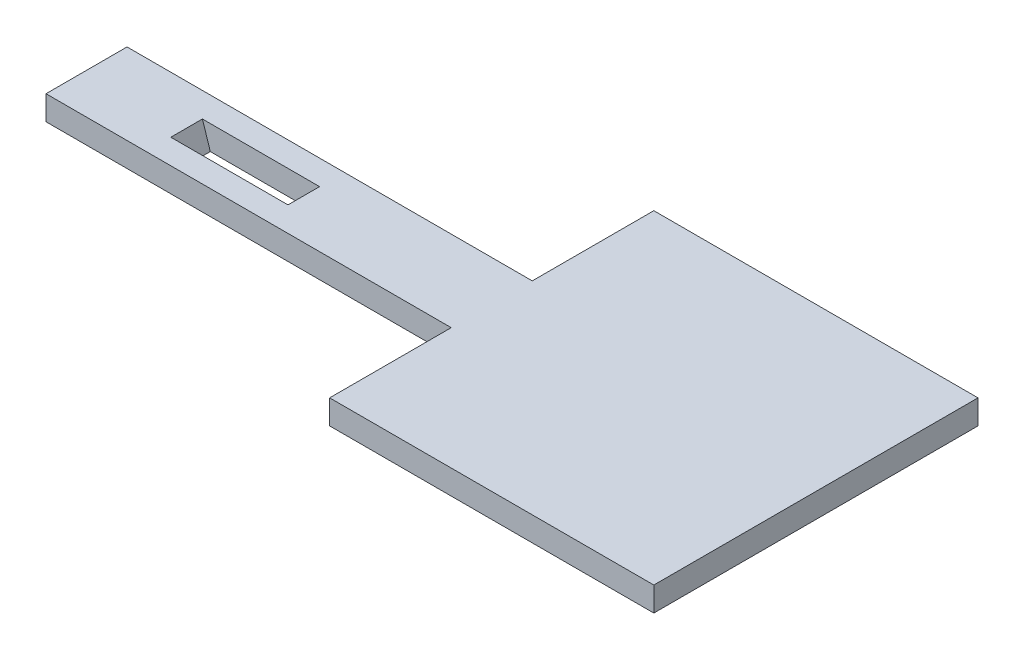
ISO-10303-21;
HEADER;
FILE_DESCRIPTION(('STEP AP214'),'2;1');
FILE_NAME('part.step','',(''),(''),'','','');
FILE_SCHEMA(('AUTOMOTIVE_DESIGN { 1 0 10303 214 1 1 1 1 }'));
ENDSEC;
DATA;
#1=APPLICATION_CONTEXT('core data for automotive mechanical design processes');
#2=APPLICATION_PROTOCOL_DEFINITION('international standard','automotive_design',2000,#1);
#3=PRODUCT_CONTEXT('',#1,'mechanical');
#4=PRODUCT('Part','Part','',(#3));
#5=PRODUCT_RELATED_PRODUCT_CATEGORY('part','',(#4));
#6=PRODUCT_DEFINITION_FORMATION('','',#4);
#7=PRODUCT_DEFINITION_CONTEXT('part definition',#1,'design');
#8=PRODUCT_DEFINITION('design','',#6,#7);
#9=PRODUCT_DEFINITION_SHAPE('','',#8);
#10=(LENGTH_UNIT() NAMED_UNIT(*) SI_UNIT(.MILLI.,.METRE.));
#11=(NAMED_UNIT(*) PLANE_ANGLE_UNIT() SI_UNIT($,.RADIAN.));
#12=(NAMED_UNIT(*) SI_UNIT($,.STERADIAN.) SOLID_ANGLE_UNIT());
#13=UNCERTAINTY_MEASURE_WITH_UNIT(LENGTH_MEASURE(1.E-05),#10,'distance_accuracy_value','');
#14=(GEOMETRIC_REPRESENTATION_CONTEXT(3) GLOBAL_UNCERTAINTY_ASSIGNED_CONTEXT((#13)) GLOBAL_UNIT_ASSIGNED_CONTEXT((#10,
#11,#12)) REPRESENTATION_CONTEXT('',''));
#15=CARTESIAN_POINT('',(0.,0.,0.));
#16=DIRECTION('',(0.,0.,1.));
#17=DIRECTION('',(1.,0.,0.));
#18=AXIS2_PLACEMENT_3D('',#15,#16,#17);
#19=CARTESIAN_POINT('',(-28.,3.,-5.31578947368421));
#20=DIRECTION('',(1.,0.,0.));
#21=DIRECTION('',(0.,0.,-1.));
#22=AXIS2_PLACEMENT_3D('',#19,#20,#21);
#23=PLANE('',#22);
#24=DIRECTION('',(0.,0.,1.));
#25=VECTOR('',#24,1.);
#26=CARTESIAN_POINT('',(-28.,0.,-5.31578947368421));
#27=LINE('',#26,#25);
#28=CARTESIAN_POINT('',(-28.,0.,-5.31578947368421));
#29=VERTEX_POINT('',#28);
#30=CARTESIAN_POINT('',(-28.,0.,4.68421052631579));
#31=VERTEX_POINT('',#30);
#32=EDGE_CURVE('E154',#29,#31,#27,.T.);
#33=ORIENTED_EDGE('',*,*,#32,.T.);
#34=DIRECTION('',(0.,-1.,0.));
#35=VECTOR('',#34,1.);
#36=CARTESIAN_POINT('',(-28.,3.,4.68421052631579));
#37=LINE('',#36,#35);
#38=CARTESIAN_POINT('',(-28.,3.,4.68421052631579));
#39=VERTEX_POINT('',#38);
#40=EDGE_CURVE('E11',#39,#31,#37,.T.);
#41=ORIENTED_EDGE('',*,*,#40,.F.);
#42=DIRECTION('',(0.,0.,1.));
#43=VECTOR('',#42,1.);
#44=CARTESIAN_POINT('',(-28.,3.,-5.31578947368421));
#45=LINE('',#44,#43);
#46=CARTESIAN_POINT('',(-28.,3.,-5.31578947368421));
#47=VERTEX_POINT('',#46);
#48=EDGE_CURVE('E159',#47,#39,#45,.T.);
#49=ORIENTED_EDGE('',*,*,#48,.F.);
#50=DIRECTION('',(0.,-1.,0.));
#51=VECTOR('',#50,1.);
#52=CARTESIAN_POINT('',(-28.,3.,-5.31578947368421));
#53=LINE('',#52,#51);
#54=EDGE_CURVE('E177',#47,#29,#53,.T.);
#55=ORIENTED_EDGE('',*,*,#54,.T.);
#56=EDGE_LOOP('',(#33,#41,#49,#55));
#57=FACE_BOUND('',#56,.T.);
#58=ADVANCED_FACE('F32',(#57),#23,.F.);
#59=CARTESIAN_POINT('',(-28.,3.,4.68421052631579));
#60=DIRECTION('',(0.,0.,-1.));
#61=DIRECTION('',(-1.,0.,0.));
#62=AXIS2_PLACEMENT_3D('',#59,#60,#61);
#63=PLANE('',#62);
#64=DIRECTION('',(1.,0.,0.));
#65=VECTOR('',#64,1.);
#66=CARTESIAN_POINT('',(-28.,0.,4.68421052631579));
#67=LINE('',#66,#65);
#68=CARTESIAN_POINT('',(22.,0.,4.68421052631579));
#69=VERTEX_POINT('',#68);
#70=EDGE_CURVE('E180',#31,#69,#67,.T.);
#71=ORIENTED_EDGE('',*,*,#70,.T.);
#72=DIRECTION('',(0.,-1.,0.));
#73=VECTOR('',#72,1.);
#74=CARTESIAN_POINT('',(22.,3.,4.68421052631579));
#75=LINE('',#74,#73);
#76=CARTESIAN_POINT('',(22.,3.,4.68421052631579));
#77=VERTEX_POINT('',#76);
#78=EDGE_CURVE('E39',#77,#69,#75,.T.);
#79=ORIENTED_EDGE('',*,*,#78,.F.);
#80=DIRECTION('',(1.,0.,0.));
#81=VECTOR('',#80,1.);
#82=CARTESIAN_POINT('',(-28.,3.,4.68421052631579));
#83=LINE('',#82,#81);
#84=EDGE_CURVE('E162',#39,#77,#83,.T.);
#85=ORIENTED_EDGE('',*,*,#84,.F.);
#86=ORIENTED_EDGE('',*,*,#40,.T.);
#87=EDGE_LOOP('',(#71,#79,#85,#86));
#88=FACE_BOUND('',#87,.T.);
#89=ADVANCED_FACE('F235',(#88),#63,.F.);
#90=CARTESIAN_POINT('',(22.,3.,19.6842105263158));
#91=DIRECTION('',(1.,0.,0.));
#92=DIRECTION('',(0.,0.,-1.));
#93=AXIS2_PLACEMENT_3D('',#90,#91,#92);
#94=PLANE('',#93);
#95=DIRECTION('',(0.,0.,1.));
#96=VECTOR('',#95,1.);
#97=CARTESIAN_POINT('',(22.,0.,19.6842105263158));
#98=LINE('',#97,#96);
#99=CARTESIAN_POINT('',(22.,0.,19.6842105263158));
#100=VERTEX_POINT('',#99);
#101=EDGE_CURVE('E182',#69,#100,#98,.T.);
#102=ORIENTED_EDGE('',*,*,#101,.T.);
#103=DIRECTION('',(0.,-1.,0.));
#104=VECTOR('',#103,1.);
#105=CARTESIAN_POINT('',(22.,3.,19.6842105263158));
#106=LINE('',#105,#104);
#107=CARTESIAN_POINT('',(22.,3.,19.6842105263158));
#108=VERTEX_POINT('',#107);
#109=EDGE_CURVE('E207',#108,#100,#106,.T.);
#110=ORIENTED_EDGE('',*,*,#109,.F.);
#111=DIRECTION('',(0.,0.,1.));
#112=VECTOR('',#111,1.);
#113=CARTESIAN_POINT('',(22.,3.,19.6842105263158));
#114=LINE('',#113,#112);
#115=EDGE_CURVE('E165',#77,#108,#114,.T.);
#116=ORIENTED_EDGE('',*,*,#115,.F.);
#117=ORIENTED_EDGE('',*,*,#78,.T.);
#118=EDGE_LOOP('',(#102,#110,#116,#117));
#119=FACE_BOUND('',#118,.T.);
#120=ADVANCED_FACE('F214',(#119),#94,.F.);
#121=CARTESIAN_POINT('',(62.,3.,19.6842105263158));
#122=DIRECTION('',(0.,0.,-1.));
#123=DIRECTION('',(-1.,0.,0.));
#124=AXIS2_PLACEMENT_3D('',#121,#122,#123);
#125=PLANE('',#124);
#126=DIRECTION('',(1.,0.,0.));
#127=VECTOR('',#126,1.);
#128=CARTESIAN_POINT('',(62.,0.,19.6842105263158));
#129=LINE('',#128,#127);
#130=CARTESIAN_POINT('',(62.,0.,19.6842105263158));
#131=VERTEX_POINT('',#130);
#132=EDGE_CURVE('E184',#100,#131,#129,.T.);
#133=ORIENTED_EDGE('',*,*,#132,.T.);
#134=DIRECTION('',(0.,-1.,0.));
#135=VECTOR('',#134,1.);
#136=CARTESIAN_POINT('',(62.,3.,19.6842105263158));
#137=LINE('',#136,#135);
#138=CARTESIAN_POINT('',(62.,3.,19.6842105263158));
#139=VERTEX_POINT('',#138);
#140=EDGE_CURVE('E204',#139,#131,#137,.T.);
#141=ORIENTED_EDGE('',*,*,#140,.F.);
#142=DIRECTION('',(1.,0.,0.));
#143=VECTOR('',#142,1.);
#144=CARTESIAN_POINT('',(62.,3.,19.6842105263158));
#145=LINE('',#144,#143);
#146=EDGE_CURVE('E167',#108,#139,#145,.T.);
#147=ORIENTED_EDGE('',*,*,#146,.F.);
#148=ORIENTED_EDGE('',*,*,#109,.T.);
#149=EDGE_LOOP('',(#133,#141,#147,#148));
#150=FACE_BOUND('',#149,.T.);
#151=ADVANCED_FACE('F223',(#150),#125,.F.);
#152=CARTESIAN_POINT('',(62.,3.,-20.3157894736842));
#153=DIRECTION('',(-1.,0.,0.));
#154=DIRECTION('',(0.,0.,1.));
#155=AXIS2_PLACEMENT_3D('',#152,#153,#154);
#156=PLANE('',#155);
#157=DIRECTION('',(0.,0.,-1.));
#158=VECTOR('',#157,1.);
#159=CARTESIAN_POINT('',(62.,0.,-20.3157894736842));
#160=LINE('',#159,#158);
#161=CARTESIAN_POINT('',(62.,0.,-20.3157894736842));
#162=VERTEX_POINT('',#161);
#163=EDGE_CURVE('E186',#131,#162,#160,.T.);
#164=ORIENTED_EDGE('',*,*,#163,.T.);
#165=DIRECTION('',(0.,-1.,0.));
#166=VECTOR('',#165,1.);
#167=CARTESIAN_POINT('',(62.,3.,-20.3157894736842));
#168=LINE('',#167,#166);
#169=CARTESIAN_POINT('',(62.,3.,-20.3157894736842));
#170=VERTEX_POINT('',#169);
#171=EDGE_CURVE('E201',#170,#162,#168,.T.);
#172=ORIENTED_EDGE('',*,*,#171,.F.);
#173=DIRECTION('',(0.,0.,-1.));
#174=VECTOR('',#173,1.);
#175=CARTESIAN_POINT('',(62.,3.,-20.3157894736842));
#176=LINE('',#175,#174);
#177=EDGE_CURVE('E169',#139,#170,#176,.T.);
#178=ORIENTED_EDGE('',*,*,#177,.F.);
#179=ORIENTED_EDGE('',*,*,#140,.T.);
#180=EDGE_LOOP('',(#164,#172,#178,#179));
#181=FACE_BOUND('',#180,.T.);
#182=ADVANCED_FACE('F227',(#181),#156,.F.);
#183=CARTESIAN_POINT('',(22.,3.,-20.3157894736842));
#184=DIRECTION('',(0.,0.,1.));
#185=DIRECTION('',(1.,0.,0.));
#186=AXIS2_PLACEMENT_3D('',#183,#184,#185);
#187=PLANE('',#186);
#188=DIRECTION('',(-1.,0.,0.));
#189=VECTOR('',#188,1.);
#190=CARTESIAN_POINT('',(22.,0.,-20.3157894736842));
#191=LINE('',#190,#189);
#192=CARTESIAN_POINT('',(22.,0.,-20.3157894736842));
#193=VERTEX_POINT('',#192);
#194=EDGE_CURVE('E188',#162,#193,#191,.T.);
#195=ORIENTED_EDGE('',*,*,#194,.T.);
#196=DIRECTION('',(0.,-1.,0.));
#197=VECTOR('',#196,1.);
#198=CARTESIAN_POINT('',(22.,3.,-20.3157894736842));
#199=LINE('',#198,#197);
#200=CARTESIAN_POINT('',(22.,3.,-20.3157894736842));
#201=VERTEX_POINT('',#200);
#202=EDGE_CURVE('E198',#201,#193,#199,.T.);
#203=ORIENTED_EDGE('',*,*,#202,.F.);
#204=DIRECTION('',(-1.,0.,0.));
#205=VECTOR('',#204,1.);
#206=CARTESIAN_POINT('',(22.,3.,-20.3157894736842));
#207=LINE('',#206,#205);
#208=EDGE_CURVE('E171',#170,#201,#207,.T.);
#209=ORIENTED_EDGE('',*,*,#208,.F.);
#210=ORIENTED_EDGE('',*,*,#171,.T.);
#211=EDGE_LOOP('',(#195,#203,#209,#210));
#212=FACE_BOUND('',#211,.T.);
#213=ADVANCED_FACE('F248',(#212),#187,.F.);
#214=CARTESIAN_POINT('',(22.,3.,-5.31578947368422));
#215=DIRECTION('',(1.,0.,0.));
#216=DIRECTION('',(0.,0.,-1.));
#217=AXIS2_PLACEMENT_3D('',#214,#215,#216);
#218=PLANE('',#217);
#219=DIRECTION('',(0.,0.,1.));
#220=VECTOR('',#219,1.);
#221=CARTESIAN_POINT('',(22.,0.,-5.31578947368422));
#222=LINE('',#221,#220);
#223=CARTESIAN_POINT('',(22.,0.,-5.31578947368422));
#224=VERTEX_POINT('',#223);
#225=EDGE_CURVE('E190',#193,#224,#222,.T.);
#226=ORIENTED_EDGE('',*,*,#225,.T.);
#227=DIRECTION('',(0.,-1.,0.));
#228=VECTOR('',#227,1.);
#229=CARTESIAN_POINT('',(22.,3.,-5.31578947368422));
#230=LINE('',#229,#228);
#231=CARTESIAN_POINT('',(22.,3.,-5.31578947368422));
#232=VERTEX_POINT('',#231);
#233=EDGE_CURVE('E195',#232,#224,#230,.T.);
#234=ORIENTED_EDGE('',*,*,#233,.F.);
#235=DIRECTION('',(0.,0.,1.));
#236=VECTOR('',#235,1.);
#237=CARTESIAN_POINT('',(22.,3.,-5.31578947368422));
#238=LINE('',#237,#236);
#239=EDGE_CURVE('E173',#201,#232,#238,.T.);
#240=ORIENTED_EDGE('',*,*,#239,.F.);
#241=ORIENTED_EDGE('',*,*,#202,.T.);
#242=EDGE_LOOP('',(#226,#234,#240,#241));
#243=FACE_BOUND('',#242,.T.);
#244=ADVANCED_FACE('F246',(#243),#218,.F.);
#245=CARTESIAN_POINT('',(-28.,3.,-5.31578947368421));
#246=DIRECTION('',(0.,0.,1.));
#247=DIRECTION('',(1.,0.,0.));
#248=AXIS2_PLACEMENT_3D('',#245,#246,#247);
#249=PLANE('',#248);
#250=DIRECTION('',(-1.,0.,0.));
#251=VECTOR('',#250,1.);
#252=CARTESIAN_POINT('',(-28.,0.,-5.31578947368421));
#253=LINE('',#252,#251);
#254=EDGE_CURVE('E163',#224,#29,#253,.T.);
#255=ORIENTED_EDGE('',*,*,#254,.T.);
#256=ORIENTED_EDGE('',*,*,#54,.F.);
#257=DIRECTION('',(-1.,0.,0.));
#258=VECTOR('',#257,1.);
#259=CARTESIAN_POINT('',(-28.,3.,-5.31578947368421));
#260=LINE('',#259,#258);
#261=EDGE_CURVE('E175',#232,#47,#260,.T.);
#262=ORIENTED_EDGE('',*,*,#261,.F.);
#263=ORIENTED_EDGE('',*,*,#233,.T.);
#264=EDGE_LOOP('',(#255,#256,#262,#263));
#265=FACE_BOUND('',#264,.T.);
#266=ADVANCED_FACE('F241',(#265),#249,.F.);
#267=CARTESIAN_POINT('',(0.,3.,0.));
#268=DIRECTION('',(0.,1.,0.));
#269=DIRECTION('',(0.,0.,1.));
#270=AXIS2_PLACEMENT_3D('',#267,#268,#269);
#271=PLANE('',#270);
#272=DIRECTION('',(-1.,0.,0.));
#273=VECTOR('',#272,1.);
#274=CARTESIAN_POINT('',(-15.6497590886987,3.,-2.26578947368421));
#275=LINE('',#274,#273);
#276=CARTESIAN_POINT('',(-1.19215350542255,3.,-2.26578947368421));
#277=VERTEX_POINT('',#276);
#278=CARTESIAN_POINT('',(-15.6497590886987,3.,-2.26578947368421));
#279=VERTEX_POINT('',#278);
#280=EDGE_CURVE('E127',#277,#279,#275,.T.);
#281=ORIENTED_EDGE('',*,*,#280,.F.);
#282=DIRECTION('',(0.,0.,1.));
#283=VECTOR('',#282,1.);
#284=CARTESIAN_POINT('',(-1.19215350542255,3.,-2.26578947368421));
#285=LINE('',#284,#283);
#286=CARTESIAN_POINT('',(-1.19215350542255,3.,1.63421052631579));
#287=VERTEX_POINT('',#286);
#288=EDGE_CURVE('E155',#277,#287,#285,.T.);
#289=ORIENTED_EDGE('',*,*,#288,.T.);
#290=DIRECTION('',(-1.,0.,0.));
#291=VECTOR('',#290,1.);
#292=CARTESIAN_POINT('',(-15.6497590886987,3.,1.63421052631579));
#293=LINE('',#292,#291);
#294=CARTESIAN_POINT('',(-15.6497590886987,3.,1.63421052631579));
#295=VERTEX_POINT('',#294);
#296=EDGE_CURVE('E137',#287,#295,#293,.T.);
#297=ORIENTED_EDGE('',*,*,#296,.T.);
#298=DIRECTION('',(0.,0.,1.));
#299=VECTOR('',#298,1.);
#300=CARTESIAN_POINT('',(-15.6497590886987,3.,-2.26578947368421));
#301=LINE('',#300,#299);
#302=EDGE_CURVE('E152',#279,#295,#301,.T.);
#303=ORIENTED_EDGE('',*,*,#302,.F.);
#304=EDGE_LOOP('',(#281,#289,#297,#303));
#305=FACE_BOUND('',#304,.T.);
#306=ORIENTED_EDGE('',*,*,#48,.T.);
#307=ORIENTED_EDGE('',*,*,#84,.T.);
#308=ORIENTED_EDGE('',*,*,#115,.T.);
#309=ORIENTED_EDGE('',*,*,#146,.T.);
#310=ORIENTED_EDGE('',*,*,#177,.T.);
#311=ORIENTED_EDGE('',*,*,#208,.T.);
#312=ORIENTED_EDGE('',*,*,#239,.T.);
#313=ORIENTED_EDGE('',*,*,#261,.T.);
#314=EDGE_LOOP('',(#306,#307,#308,#309,#310,#311,#312,#313));
#315=FACE_BOUND('',#314,.T.);
#316=ADVANCED_FACE('F231',(#305,#315),#271,.T.);
#317=CARTESIAN_POINT('',(0.,0.,0.));
#318=DIRECTION('',(0.,1.,0.));
#319=DIRECTION('',(0.,0.,1.));
#320=AXIS2_PLACEMENT_3D('',#317,#318,#319);
#321=PLANE('',#320);
#322=DIRECTION('',(0.,0.,1.));
#323=VECTOR('',#322,1.);
#324=CARTESIAN_POINT('',(-0.217394416723821,0.,-2.26578947368421));
#325=LINE('',#324,#323);
#326=CARTESIAN_POINT('',(-0.217394416723821,0.,-2.26578947368421));
#327=VERTEX_POINT('',#326);
#328=CARTESIAN_POINT('',(-0.217394416723821,0.,1.63421052631579));
#329=VERTEX_POINT('',#328);
#330=EDGE_CURVE('E126',#327,#329,#325,.T.);
#331=ORIENTED_EDGE('',*,*,#330,.F.);
#332=DIRECTION('',(1.,0.,0.));
#333=VECTOR('',#332,1.);
#334=CARTESIAN_POINT('',(-14.675,0.,-2.26578947368421));
#335=LINE('',#334,#333);
#336=CARTESIAN_POINT('',(-14.675,0.,-2.26578947368421));
#337=VERTEX_POINT('',#336);
#338=EDGE_CURVE('E133',#337,#327,#335,.T.);
#339=ORIENTED_EDGE('',*,*,#338,.F.);
#340=DIRECTION('',(0.,0.,1.));
#341=VECTOR('',#340,1.);
#342=CARTESIAN_POINT('',(-14.675,0.,-2.26578947368421));
#343=LINE('',#342,#341);
#344=CARTESIAN_POINT('',(-14.675,0.,1.63421052631579));
#345=VERTEX_POINT('',#344);
#346=EDGE_CURVE('E118',#337,#345,#343,.T.);
#347=ORIENTED_EDGE('',*,*,#346,.T.);
#348=DIRECTION('',(1.,0.,0.));
#349=VECTOR('',#348,1.);
#350=CARTESIAN_POINT('',(-14.675,0.,1.63421052631579));
#351=LINE('',#350,#349);
#352=EDGE_CURVE('E147',#345,#329,#351,.T.);
#353=ORIENTED_EDGE('',*,*,#352,.T.);
#354=EDGE_LOOP('',(#331,#339,#347,#353));
#355=FACE_BOUND('',#354,.T.);
#356=ORIENTED_EDGE('',*,*,#32,.F.);
#357=ORIENTED_EDGE('',*,*,#254,.F.);
#358=ORIENTED_EDGE('',*,*,#225,.F.);
#359=ORIENTED_EDGE('',*,*,#194,.F.);
#360=ORIENTED_EDGE('',*,*,#163,.F.);
#361=ORIENTED_EDGE('',*,*,#132,.F.);
#362=ORIENTED_EDGE('',*,*,#101,.F.);
#363=ORIENTED_EDGE('',*,*,#70,.F.);
#364=EDGE_LOOP('',(#356,#357,#358,#359,#360,#361,#362,#363));
#365=FACE_BOUND('',#364,.T.);
#366=ADVANCED_FACE('F139',(#355,#365),#321,.F.);
#367=CARTESIAN_POINT('',(-14.675,0.,-2.26578947368421));
#368=DIRECTION('',(-0.951056516295153,-0.309016994374949,0.));
#369=DIRECTION('',(0.309016994374949,-0.951056516295153,0.));
#370=AXIS2_PLACEMENT_3D('',#367,#368,#369);
#371=PLANE('',#370);
#372=DIRECTION('',(0.309016994374949,-0.951056516295153,0.));
#373=VECTOR('',#372,1.);
#374=CARTESIAN_POINT('',(-14.675,0.,1.63421052631579));
#375=LINE('',#374,#373);
#376=EDGE_CURVE('E46',#295,#345,#375,.T.);
#377=ORIENTED_EDGE('',*,*,#376,.T.);
#378=ORIENTED_EDGE('',*,*,#346,.F.);
#379=DIRECTION('',(0.309016994374949,-0.951056516295153,0.));
#380=VECTOR('',#379,1.);
#381=CARTESIAN_POINT('',(-14.675,0.,-2.26578947368421));
#382=LINE('',#381,#380);
#383=EDGE_CURVE('E121',#279,#337,#382,.T.);
#384=ORIENTED_EDGE('',*,*,#383,.F.);
#385=ORIENTED_EDGE('',*,*,#302,.T.);
#386=EDGE_LOOP('',(#377,#378,#384,#385));
#387=FACE_BOUND('',#386,.T.);
#388=ADVANCED_FACE('F120',(#387),#371,.F.);
#389=CARTESIAN_POINT('',(-0.217394416723821,0.,-2.26578947368421));
#390=DIRECTION('',(0.951056516295153,0.30901699437495,0.));
#391=DIRECTION('',(-0.30901699437495,0.951056516295153,0.));
#392=AXIS2_PLACEMENT_3D('',#389,#390,#391);
#393=PLANE('',#392);
#394=DIRECTION('',(-0.30901699437495,0.951056516295153,0.));
#395=VECTOR('',#394,1.);
#396=CARTESIAN_POINT('',(-0.217394416723821,0.,1.63421052631579));
#397=LINE('',#396,#395);
#398=EDGE_CURVE('E51',#329,#287,#397,.T.);
#399=ORIENTED_EDGE('',*,*,#398,.T.);
#400=ORIENTED_EDGE('',*,*,#288,.F.);
#401=DIRECTION('',(-0.30901699437495,0.951056516295153,0.));
#402=VECTOR('',#401,1.);
#403=CARTESIAN_POINT('',(-0.217394416723821,0.,-2.26578947368421));
#404=LINE('',#403,#402);
#405=EDGE_CURVE('E141',#327,#277,#404,.T.);
#406=ORIENTED_EDGE('',*,*,#405,.F.);
#407=ORIENTED_EDGE('',*,*,#330,.T.);
#408=EDGE_LOOP('',(#399,#400,#406,#407));
#409=FACE_BOUND('',#408,.T.);
#410=ADVANCED_FACE('F319',(#409),#393,.F.);
#411=CARTESIAN_POINT('',(0.,0.,-2.26578947368421));
#412=DIRECTION('',(0.,0.,-1.));
#413=DIRECTION('',(-1.,0.,0.));
#414=AXIS2_PLACEMENT_3D('',#411,#412,#413);
#415=PLANE('',#414);
#416=ORIENTED_EDGE('',*,*,#383,.T.);
#417=ORIENTED_EDGE('',*,*,#338,.T.);
#418=ORIENTED_EDGE('',*,*,#405,.T.);
#419=ORIENTED_EDGE('',*,*,#280,.T.);
#420=EDGE_LOOP('',(#416,#417,#418,#419));
#421=FACE_BOUND('',#420,.T.);
#422=ADVANCED_FACE('F131',(#421),#415,.F.);
#423=CARTESIAN_POINT('',(0.,0.,1.63421052631579));
#424=DIRECTION('',(0.,0.,-1.));
#425=DIRECTION('',(-1.,0.,0.));
#426=AXIS2_PLACEMENT_3D('',#423,#424,#425);
#427=PLANE('',#426);
#428=ORIENTED_EDGE('',*,*,#376,.F.);
#429=ORIENTED_EDGE('',*,*,#296,.F.);
#430=ORIENTED_EDGE('',*,*,#398,.F.);
#431=ORIENTED_EDGE('',*,*,#352,.F.);
#432=EDGE_LOOP('',(#428,#429,#430,#431));
#433=FACE_BOUND('',#432,.T.);
#434=ADVANCED_FACE('F337',(#433),#427,.T.);
#435=CLOSED_SHELL('',(#58,#89,#120,#151,#182,#213,#244,#266,#316,#366,#388,#410,#422,#434));
#436=MANIFOLD_SOLID_BREP('B2',#435);
#437=ADVANCED_BREP_SHAPE_REPRESENTATION('',(#18,#436),#14);
#438=SHAPE_DEFINITION_REPRESENTATION(#9,#437);
ENDSEC;
END-ISO-10303-21;
